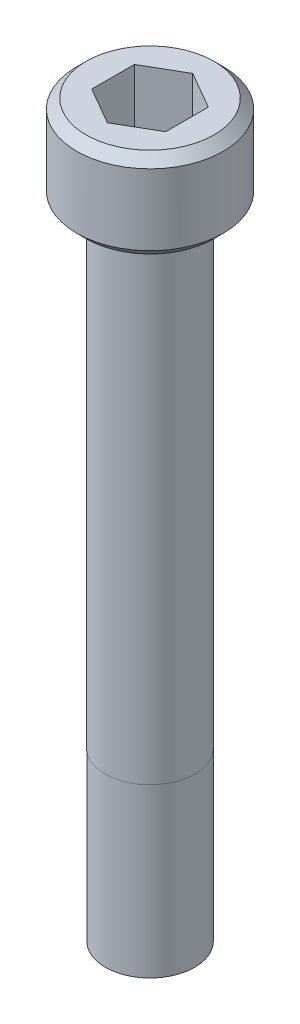
ISO-10303-21;
HEADER;
FILE_DESCRIPTION(('STEP AP214'),'2;1');
FILE_NAME('part.step','',(''),(''),'','','');
FILE_SCHEMA(('AUTOMOTIVE_DESIGN { 1 0 10303 214 1 1 1 1 }'));
ENDSEC;
DATA;
#1=APPLICATION_CONTEXT('core data for automotive mechanical design processes');
#2=APPLICATION_PROTOCOL_DEFINITION('international standard','automotive_design',2000,#1);
#3=PRODUCT_CONTEXT('',#1,'mechanical');
#4=PRODUCT('Part','Part','',(#3));
#5=PRODUCT_RELATED_PRODUCT_CATEGORY('part','',(#4));
#6=PRODUCT_DEFINITION_FORMATION('','',#4);
#7=PRODUCT_DEFINITION_CONTEXT('part definition',#1,'design');
#8=PRODUCT_DEFINITION('design','',#6,#7);
#9=PRODUCT_DEFINITION_SHAPE('','',#8);
#10=(LENGTH_UNIT() NAMED_UNIT(*) SI_UNIT(.MILLI.,.METRE.));
#11=(NAMED_UNIT(*) PLANE_ANGLE_UNIT() SI_UNIT($,.RADIAN.));
#12=(NAMED_UNIT(*) SI_UNIT($,.STERADIAN.) SOLID_ANGLE_UNIT());
#13=UNCERTAINTY_MEASURE_WITH_UNIT(LENGTH_MEASURE(1.E-05),#10,'distance_accuracy_value','');
#14=(GEOMETRIC_REPRESENTATION_CONTEXT(3) GLOBAL_UNCERTAINTY_ASSIGNED_CONTEXT((#13)) GLOBAL_UNIT_ASSIGNED_CONTEXT((#10,
#11,#12)) REPRESENTATION_CONTEXT('',''));
#15=CARTESIAN_POINT('',(0.,0.,0.));
#16=DIRECTION('',(0.,0.,1.));
#17=DIRECTION('',(1.,0.,0.));
#18=AXIS2_PLACEMENT_3D('',#15,#16,#17);
#19=CARTESIAN_POINT('',(1.984375,1.8494375,3.43703832126949));
#20=DIRECTION('',(0.,1.,0.));
#21=DIRECTION('',(0.,0.,1.));
#22=AXIS2_PLACEMENT_3D('',#19,#20,#21);
#23=PLANE('',#22);
#24=DIRECTION('',(-0.866025403784439,0.,0.5));
#25=VECTOR('',#24,1.);
#26=CARTESIAN_POINT('',(0.,1.8494375,-2.29135888084633));
#27=LINE('',#26,#25);
#28=CARTESIAN_POINT('',(0.,1.8494375,-2.29135888084633));
#29=VERTEX_POINT('',#28);
#30=CARTESIAN_POINT('',(-1.984375,1.8494375,-1.14567944042316));
#31=VERTEX_POINT('',#30);
#32=EDGE_CURVE('E68',#29,#31,#27,.T.);
#33=ORIENTED_EDGE('',*,*,#32,.T.);
#34=DIRECTION('',(0.,0.,1.));
#35=VECTOR('',#34,1.);
#36=CARTESIAN_POINT('',(-1.984375,1.8494375,-1.14567944042316));
#37=LINE('',#36,#35);
#38=CARTESIAN_POINT('',(-1.984375,1.8494375,1.14567944042316));
#39=VERTEX_POINT('',#38);
#40=EDGE_CURVE('E70',#31,#39,#37,.T.);
#41=ORIENTED_EDGE('',*,*,#40,.T.);
#42=DIRECTION('',(0.866025403784439,0.,0.499999999999999));
#43=VECTOR('',#42,1.);
#44=CARTESIAN_POINT('',(-1.984375,1.8494375,1.14567944042316));
#45=LINE('',#44,#43);
#46=CARTESIAN_POINT('',(0.,1.8494375,2.29135888084633));
#47=VERTEX_POINT('',#46);
#48=EDGE_CURVE('E72',#39,#47,#45,.T.);
#49=ORIENTED_EDGE('',*,*,#48,.T.);
#50=DIRECTION('',(0.866025403784439,0.,-0.5));
#51=VECTOR('',#50,1.);
#52=CARTESIAN_POINT('',(0.,1.8494375,2.29135888084633));
#53=LINE('',#52,#51);
#54=CARTESIAN_POINT('',(1.984375,1.8494375,1.14567944042316));
#55=VERTEX_POINT('',#54);
#56=EDGE_CURVE('E133',#47,#55,#53,.T.);
#57=ORIENTED_EDGE('',*,*,#56,.T.);
#58=DIRECTION('',(0.,0.,-1.));
#59=VECTOR('',#58,1.);
#60=CARTESIAN_POINT('',(1.984375,1.8494375,1.14567944042316));
#61=LINE('',#60,#59);
#62=CARTESIAN_POINT('',(1.984375,1.8494375,-1.14567944042316));
#63=VERTEX_POINT('',#62);
#64=EDGE_CURVE('E138',#55,#63,#61,.T.);
#65=ORIENTED_EDGE('',*,*,#64,.T.);
#66=DIRECTION('',(-0.866025403784439,0.,-0.499999999999999));
#67=VECTOR('',#66,1.);
#68=CARTESIAN_POINT('',(1.984375,1.8494375,-1.14567944042316));
#69=LINE('',#68,#67);
#70=EDGE_CURVE('E142',#63,#29,#69,.T.);
#71=ORIENTED_EDGE('',*,*,#70,.T.);
#72=EDGE_LOOP('',(#33,#41,#49,#57,#65,#71));
#73=FACE_BOUND('',#72,.T.);
#74=ADVANCED_FACE('F17',(#73),#23,.T.);
#75=CARTESIAN_POINT('',(-1.984375,1.8494375,1.14567944042316));
#76=DIRECTION('',(-0.499999999999999,0.,0.866025403784439));
#77=DIRECTION('',(0.866025403784439,0.,0.499999999999999));
#78=AXIS2_PLACEMENT_3D('',#75,#76,#77);
#79=PLANE('',#78);
#80=DIRECTION('',(0.,1.,0.));
#81=VECTOR('',#80,1.);
#82=CARTESIAN_POINT('',(0.,1.8494375,2.29135888084633));
#83=LINE('',#82,#81);
#84=CARTESIAN_POINT('',(0.,4.826,2.29135888084633));
#85=VERTEX_POINT('',#84);
#86=EDGE_CURVE('E83',#85,#47,#83,.F.);
#87=ORIENTED_EDGE('',*,*,#86,.T.);
#88=ORIENTED_EDGE('',*,*,#48,.F.);
#89=DIRECTION('',(0.,1.,0.));
#90=VECTOR('',#89,1.);
#91=CARTESIAN_POINT('',(-1.984375,1.8494375,1.14567944042316));
#92=LINE('',#91,#90);
#93=CARTESIAN_POINT('',(-1.984375,4.826,1.14567944042316));
#94=VERTEX_POINT('',#93);
#95=EDGE_CURVE('E77',#39,#94,#92,.T.);
#96=ORIENTED_EDGE('',*,*,#95,.T.);
#97=DIRECTION('',(-0.866025403784439,0.,-0.499999999999999));
#98=VECTOR('',#97,1.);
#99=CARTESIAN_POINT('',(0.,4.826,2.29135888084633));
#100=LINE('',#99,#98);
#101=EDGE_CURVE('E130',#85,#94,#100,.T.);
#102=ORIENTED_EDGE('',*,*,#101,.F.);
#103=EDGE_LOOP('',(#87,#88,#96,#102));
#104=FACE_BOUND('',#103,.T.);
#105=ADVANCED_FACE('F80',(#104),#79,.F.);
#106=CARTESIAN_POINT('',(-1.984375,1.8494375,-1.14567944042316));
#107=DIRECTION('',(-1.,0.,0.));
#108=DIRECTION('',(0.,0.,1.));
#109=AXIS2_PLACEMENT_3D('',#106,#107,#108);
#110=PLANE('',#109);
#111=ORIENTED_EDGE('',*,*,#95,.F.);
#112=ORIENTED_EDGE('',*,*,#40,.F.);
#113=DIRECTION('',(0.,1.,0.));
#114=VECTOR('',#113,1.);
#115=CARTESIAN_POINT('',(-1.984375,1.8494375,-1.14567944042316));
#116=LINE('',#115,#114);
#117=CARTESIAN_POINT('',(-1.984375,4.826,-1.14567944042316));
#118=VERTEX_POINT('',#117);
#119=EDGE_CURVE('E91',#31,#118,#116,.T.);
#120=ORIENTED_EDGE('',*,*,#119,.T.);
#121=DIRECTION('',(0.,0.,1.));
#122=VECTOR('',#121,1.);
#123=CARTESIAN_POINT('',(-1.984375,4.826,0.));
#124=LINE('',#123,#122);
#125=EDGE_CURVE('E88',#94,#118,#124,.F.);
#126=ORIENTED_EDGE('',*,*,#125,.F.);
#127=EDGE_LOOP('',(#111,#112,#120,#126));
#128=FACE_BOUND('',#127,.T.);
#129=ADVANCED_FACE('F86',(#128),#110,.F.);
#130=CARTESIAN_POINT('',(0.,1.8494375,-2.29135888084633));
#131=DIRECTION('',(-0.5,0.,-0.866025403784439));
#132=DIRECTION('',(-0.866025403784439,0.,0.5));
#133=AXIS2_PLACEMENT_3D('',#130,#131,#132);
#134=PLANE('',#133);
#135=ORIENTED_EDGE('',*,*,#119,.F.);
#136=ORIENTED_EDGE('',*,*,#32,.F.);
#137=DIRECTION('',(0.,1.,0.));
#138=VECTOR('',#137,1.);
#139=CARTESIAN_POINT('',(0.,1.8494375,-2.29135888084633));
#140=LINE('',#139,#138);
#141=CARTESIAN_POINT('',(0.,4.826,-2.29135888084633));
#142=VERTEX_POINT('',#141);
#143=EDGE_CURVE('E140',#29,#142,#140,.T.);
#144=ORIENTED_EDGE('',*,*,#143,.T.);
#145=DIRECTION('',(0.866025403784438,0.,-0.5));
#146=VECTOR('',#145,1.);
#147=CARTESIAN_POINT('',(-1.984375,4.826,-1.14567944042316));
#148=LINE('',#147,#146);
#149=EDGE_CURVE('E126',#118,#142,#148,.T.);
#150=ORIENTED_EDGE('',*,*,#149,.F.);
#151=EDGE_LOOP('',(#135,#136,#144,#150));
#152=FACE_BOUND('',#151,.T.);
#153=ADVANCED_FACE('F145',(#152),#134,.F.);
#154=CARTESIAN_POINT('',(1.984375,1.8494375,-1.14567944042316));
#155=DIRECTION('',(0.499999999999999,0.,-0.866025403784439));
#156=DIRECTION('',(-0.866025403784439,0.,-0.499999999999999));
#157=AXIS2_PLACEMENT_3D('',#154,#155,#156);
#158=PLANE('',#157);
#159=ORIENTED_EDGE('',*,*,#143,.F.);
#160=ORIENTED_EDGE('',*,*,#70,.F.);
#161=DIRECTION('',(0.,1.,0.));
#162=VECTOR('',#161,1.);
#163=CARTESIAN_POINT('',(1.984375,1.8494375,-1.14567944042316));
#164=LINE('',#163,#162);
#165=CARTESIAN_POINT('',(1.984375,4.826,-1.14567944042316));
#166=VERTEX_POINT('',#165);
#167=EDGE_CURVE('E136',#63,#166,#164,.T.);
#168=ORIENTED_EDGE('',*,*,#167,.T.);
#169=DIRECTION('',(0.866025403784439,0.,0.499999999999999));
#170=VECTOR('',#169,1.);
#171=CARTESIAN_POINT('',(0.,4.826,-2.29135888084633));
#172=LINE('',#171,#170);
#173=EDGE_CURVE('E120',#142,#166,#172,.T.);
#174=ORIENTED_EDGE('',*,*,#173,.F.);
#175=EDGE_LOOP('',(#159,#160,#168,#174));
#176=FACE_BOUND('',#175,.T.);
#177=ADVANCED_FACE('F156',(#176),#158,.F.);
#178=CARTESIAN_POINT('',(1.984375,1.8494375,1.14567944042316));
#179=DIRECTION('',(1.,0.,0.));
#180=DIRECTION('',(0.,0.,-1.));
#181=AXIS2_PLACEMENT_3D('',#178,#179,#180);
#182=PLANE('',#181);
#183=ORIENTED_EDGE('',*,*,#167,.F.);
#184=ORIENTED_EDGE('',*,*,#64,.F.);
#185=DIRECTION('',(0.,1.,0.));
#186=VECTOR('',#185,1.);
#187=CARTESIAN_POINT('',(1.984375,1.8494375,1.14567944042316));
#188=LINE('',#187,#186);
#189=CARTESIAN_POINT('',(1.984375,4.826,1.14567944042316));
#190=VERTEX_POINT('',#189);
#191=EDGE_CURVE('E35',#55,#190,#188,.T.);
#192=ORIENTED_EDGE('',*,*,#191,.T.);
#193=DIRECTION('',(0.,0.,1.));
#194=VECTOR('',#193,1.);
#195=CARTESIAN_POINT('',(1.984375,4.826,0.));
#196=LINE('',#195,#194);
#197=EDGE_CURVE('E116',#166,#190,#196,.T.);
#198=ORIENTED_EDGE('',*,*,#197,.F.);
#199=EDGE_LOOP('',(#183,#184,#192,#198));
#200=FACE_BOUND('',#199,.T.);
#201=ADVANCED_FACE('F154',(#200),#182,.F.);
#202=CARTESIAN_POINT('',(0.,1.8494375,2.29135888084633));
#203=DIRECTION('',(0.5,0.,0.866025403784439));
#204=DIRECTION('',(0.866025403784439,0.,-0.5));
#205=AXIS2_PLACEMENT_3D('',#202,#203,#204);
#206=PLANE('',#205);
#207=ORIENTED_EDGE('',*,*,#191,.F.);
#208=ORIENTED_EDGE('',*,*,#56,.F.);
#209=ORIENTED_EDGE('',*,*,#86,.F.);
#210=DIRECTION('',(-0.866025403784438,0.,0.5));
#211=VECTOR('',#210,1.);
#212=CARTESIAN_POINT('',(1.984375,4.826,1.14567944042316));
#213=LINE('',#212,#211);
#214=EDGE_CURVE('E112',#190,#85,#213,.T.);
#215=ORIENTED_EDGE('',*,*,#214,.F.);
#216=EDGE_LOOP('',(#207,#208,#209,#215));
#217=FACE_BOUND('',#216,.T.);
#218=ADVANCED_FACE('F151',(#217),#206,.F.);
#219=CARTESIAN_POINT('',(0.,4.826,0.));
#220=DIRECTION('',(0.,1.,0.));
#221=DIRECTION('',(0.,0.,1.));
#222=AXIS2_PLACEMENT_3D('',#219,#220,#221);
#223=PLANE('',#222);
#224=ORIENTED_EDGE('',*,*,#197,.T.);
#225=ORIENTED_EDGE('',*,*,#214,.T.);
#226=ORIENTED_EDGE('',*,*,#101,.T.);
#227=ORIENTED_EDGE('',*,*,#125,.T.);
#228=ORIENTED_EDGE('',*,*,#149,.T.);
#229=ORIENTED_EDGE('',*,*,#173,.T.);
#230=EDGE_LOOP('',(#224,#225,#226,#227,#228,#229));
#231=FACE_BOUND('',#230,.T.);
#232=CARTESIAN_POINT('',(0.,4.82600000003686,0.));
#233=DIRECTION('',(0.,-1.,0.));
#234=DIRECTION('',(0.,0.,-1.));
#235=AXIS2_PLACEMENT_3D('',#232,#233,#234);
#236=CIRCLE('',#235,3.42899999998281);
#237=CARTESIAN_POINT('',(0.,4.82600000003686,-3.42899999998281));
#238=VERTEX_POINT('',#237);
#239=EDGE_CURVE('E20',#238,#238,#236,.T.);
#240=ORIENTED_EDGE('',*,*,#239,.F.);
#241=EDGE_LOOP('',(#240));
#242=FACE_BOUND('',#241,.T.);
#243=ADVANCED_FACE('F148',(#231,#242),#223,.T.);
#244=CARTESIAN_POINT('',(0.,-34.925,0.));
#245=DIRECTION('',(0.,1.,0.));
#246=DIRECTION('',(0.,0.,1.));
#247=AXIS2_PLACEMENT_3D('',#244,#245,#246);
#248=PLANE('',#247);
#249=CARTESIAN_POINT('',(0.,-34.9249999998847,0.));
#250=DIRECTION('',(0.,1.,0.));
#251=DIRECTION('',(0.,0.,1.));
#252=AXIS2_PLACEMENT_3D('',#249,#250,#251);
#253=CIRCLE('',#252,1.64338000001862);
#254=CARTESIAN_POINT('',(0.,-34.9249999998847,1.64338000001862));
#255=VERTEX_POINT('',#254);
#256=EDGE_CURVE('E103',#255,#255,#253,.T.);
#257=ORIENTED_EDGE('',*,*,#256,.F.);
#258=EDGE_LOOP('',(#257));
#259=FACE_BOUND('',#258,.T.);
#260=ADVANCED_FACE('F201',(#259),#248,.F.);
#261=CARTESIAN_POINT('',(0.,4.31800000012572,0.));
#262=DIRECTION('',(0.,-1.,0.));
#263=DIRECTION('',(0.,0.,-1.));
#264=AXIS2_PLACEMENT_3D('',#261,#262,#263);
#265=CONICAL_SURFACE('',#264,3.93699999989394,0.785398163397448);
#266=ORIENTED_EDGE('',*,*,#239,.T.);
#267=EDGE_LOOP('',(#266));
#268=FACE_BOUND('',#267,.T.);
#269=CARTESIAN_POINT('',(0.,4.31799999999999,0.));
#270=DIRECTION('',(0.,-1.,0.));
#271=DIRECTION('',(0.,0.,-1.));
#272=AXIS2_PLACEMENT_3D('',#269,#270,#271);
#273=CIRCLE('',#272,3.937);
#274=CARTESIAN_POINT('',(0.,4.31799999999999,-3.937));
#275=VERTEX_POINT('',#274);
#276=EDGE_CURVE('E105',#275,#275,#273,.T.);
#277=ORIENTED_EDGE('',*,*,#276,.F.);
#278=EDGE_LOOP('',(#277));
#279=FACE_BOUND('',#278,.T.);
#280=ADVANCED_FACE('F197',(#268,#279),#265,.T.);
#281=CARTESIAN_POINT('',(0.,-34.3954058086524,0.));
#282=DIRECTION('',(0.,1.,0.));
#283=DIRECTION('',(0.,0.,1.));
#284=AXIS2_PLACEMENT_3D('',#281,#282,#283);
#285=CONICAL_SURFACE('',#284,2.40029999980607,0.96029189544426);
#286=CARTESIAN_POINT('',(0.,-34.3954058085809,0.));
#287=DIRECTION('',(0.,1.,0.));
#288=DIRECTION('',(0.,0.,1.));
#289=AXIS2_PLACEMENT_3D('',#286,#287,#288);
#290=CIRCLE('',#289,2.4003);
#291=CARTESIAN_POINT('',(0.,-34.3954058085809,2.4003));
#292=VERTEX_POINT('',#291);
#293=EDGE_CURVE('E109',#292,#292,#290,.T.);
#294=ORIENTED_EDGE('',*,*,#293,.F.);
#295=EDGE_LOOP('',(#294));
#296=FACE_BOUND('',#295,.T.);
#297=ORIENTED_EDGE('',*,*,#256,.T.);
#298=EDGE_LOOP('',(#297));
#299=FACE_BOUND('',#298,.T.);
#300=ADVANCED_FACE('F193',(#296,#299),#285,.T.);
#301=CARTESIAN_POINT('',(0.,4.826,0.));
#302=DIRECTION('',(0.,-1.,0.));
#303=DIRECTION('',(0.,0.,-1.));
#304=AXIS2_PLACEMENT_3D('',#301,#302,#303);
#305=CYLINDRICAL_SURFACE('',#304,3.937);
#306=ORIENTED_EDGE('',*,*,#276,.T.);
#307=EDGE_LOOP('',(#306));
#308=FACE_BOUND('',#307,.T.);
#309=CARTESIAN_POINT('',(0.,0.508000000024822,0.));
#310=DIRECTION('',(0.,1.,0.));
#311=DIRECTION('',(0.,0.,1.));
#312=AXIS2_PLACEMENT_3D('',#309,#310,#311);
#313=CIRCLE('',#312,3.93700000006447);
#314=CARTESIAN_POINT('',(0.,0.508000000024822,3.93700000006447));
#315=VERTEX_POINT('',#314);
#316=EDGE_CURVE('E102',#315,#315,#313,.F.);
#317=ORIENTED_EDGE('',*,*,#316,.F.);
#318=EDGE_LOOP('',(#317));
#319=FACE_BOUND('',#318,.T.);
#320=ADVANCED_FACE('F189',(#308,#319),#305,.T.);
#321=CARTESIAN_POINT('',(0.,-34.925,0.));
#322=DIRECTION('',(0.,1.,0.));
#323=DIRECTION('',(0.,0.,1.));
#324=AXIS2_PLACEMENT_3D('',#321,#322,#323);
#325=CYLINDRICAL_SURFACE('',#324,2.4003);
#326=CARTESIAN_POINT('',(0.,-25.4,0.));
#327=DIRECTION('',(0.,1.,0.));
#328=DIRECTION('',(0.,0.,1.));
#329=AXIS2_PLACEMENT_3D('',#326,#327,#328);
#330=CIRCLE('',#329,2.4003);
#331=CARTESIAN_POINT('',(0.,-25.4,2.4003));
#332=VERTEX_POINT('',#331);
#333=EDGE_CURVE('E100',#332,#332,#330,.T.);
#334=ORIENTED_EDGE('',*,*,#333,.F.);
#335=EDGE_LOOP('',(#334));
#336=FACE_BOUND('',#335,.T.);
#337=ORIENTED_EDGE('',*,*,#293,.T.);
#338=EDGE_LOOP('',(#337));
#339=FACE_BOUND('',#338,.T.);
#340=ADVANCED_FACE('F185',(#336,#339),#325,.T.);
#341=CARTESIAN_POINT('',(0.,0.507999999967979,0.));
#342=DIRECTION('',(0.,1.,0.));
#343=DIRECTION('',(0.,0.,1.));
#344=AXIS2_PLACEMENT_3D('',#341,#342,#343);
#345=CONICAL_SURFACE('',#344,3.93700000000763,0.785398163397448);
#346=CARTESIAN_POINT('',(0.,0.,0.));
#347=DIRECTION('',(0.,1.,0.));
#348=DIRECTION('',(0.,0.,1.));
#349=AXIS2_PLACEMENT_3D('',#346,#347,#348);
#350=CIRCLE('',#349,3.42900000003965);
#351=CARTESIAN_POINT('',(0.,0.,3.42900000003965));
#352=VERTEX_POINT('',#351);
#353=EDGE_CURVE('E97',#352,#352,#350,.T.);
#354=ORIENTED_EDGE('',*,*,#353,.T.);
#355=EDGE_LOOP('',(#354));
#356=FACE_BOUND('',#355,.T.);
#357=ORIENTED_EDGE('',*,*,#316,.T.);
#358=EDGE_LOOP('',(#357));
#359=FACE_BOUND('',#358,.T.);
#360=ADVANCED_FACE('F181',(#356,#359),#345,.T.);
#361=CARTESIAN_POINT('',(0.,-25.4,0.));
#362=DIRECTION('',(0.,-1.,0.));
#363=DIRECTION('',(0.,0.,-1.));
#364=AXIS2_PLACEMENT_3D('',#361,#362,#363);
#365=PLANE('',#364);
#366=ORIENTED_EDGE('',*,*,#333,.T.);
#367=EDGE_LOOP('',(#366));
#368=FACE_BOUND('',#367,.T.);
#369=CARTESIAN_POINT('',(0.,-25.4,0.));
#370=DIRECTION('',(0.,1.,0.));
#371=DIRECTION('',(0.,0.,1.));
#372=AXIS2_PLACEMENT_3D('',#369,#370,#371);
#373=CIRCLE('',#372,2.413);
#374=CARTESIAN_POINT('',(0.,-25.4,2.413));
#375=VERTEX_POINT('',#374);
#376=EDGE_CURVE('E26',#375,#375,#373,.T.);
#377=ORIENTED_EDGE('',*,*,#376,.F.);
#378=EDGE_LOOP('',(#377));
#379=FACE_BOUND('',#378,.T.);
#380=ADVANCED_FACE('F174',(#368,#379),#365,.T.);
#381=CARTESIAN_POINT('',(0.,0.,0.));
#382=DIRECTION('',(0.,1.,0.));
#383=DIRECTION('',(0.,0.,1.));
#384=AXIS2_PLACEMENT_3D('',#381,#382,#383);
#385=PLANE('',#384);
#386=CARTESIAN_POINT('',(0.,0.,0.));
#387=DIRECTION('',(0.,1.,0.));
#388=DIRECTION('',(0.,0.,1.));
#389=AXIS2_PLACEMENT_3D('',#386,#387,#388);
#390=CIRCLE('',#389,2.413);
#391=CARTESIAN_POINT('',(0.,0.,2.413));
#392=VERTEX_POINT('',#391);
#393=EDGE_CURVE('E11',#392,#392,#390,.F.);
#394=ORIENTED_EDGE('',*,*,#393,.F.);
#395=EDGE_LOOP('',(#394));
#396=FACE_BOUND('',#395,.T.);
#397=ORIENTED_EDGE('',*,*,#353,.F.);
#398=EDGE_LOOP('',(#397));
#399=FACE_BOUND('',#398,.T.);
#400=ADVANCED_FACE('F168',(#396,#399),#385,.F.);
#401=CARTESIAN_POINT('',(0.,-34.925,0.));
#402=DIRECTION('',(0.,1.,0.));
#403=DIRECTION('',(0.,0.,1.));
#404=AXIS2_PLACEMENT_3D('',#401,#402,#403);
#405=CYLINDRICAL_SURFACE('',#404,2.413);
#406=ORIENTED_EDGE('',*,*,#393,.T.);
#407=EDGE_LOOP('',(#406));
#408=FACE_BOUND('',#407,.T.);
#409=ORIENTED_EDGE('',*,*,#376,.T.);
#410=EDGE_LOOP('',(#409));
#411=FACE_BOUND('',#410,.T.);
#412=ADVANCED_FACE('F166',(#408,#411),#405,.T.);
#413=CLOSED_SHELL('',(#74,#105,#129,#153,#177,#201,#218,#243,#260,#280,#300,#320,#340,#360,#380,
#400,#412));
#414=MANIFOLD_SOLID_BREP('B1',#413);
#415=ADVANCED_BREP_SHAPE_REPRESENTATION('',(#18,#414),#14);
#416=SHAPE_DEFINITION_REPRESENTATION(#9,#415);
ENDSEC;
END-ISO-10303-21;
